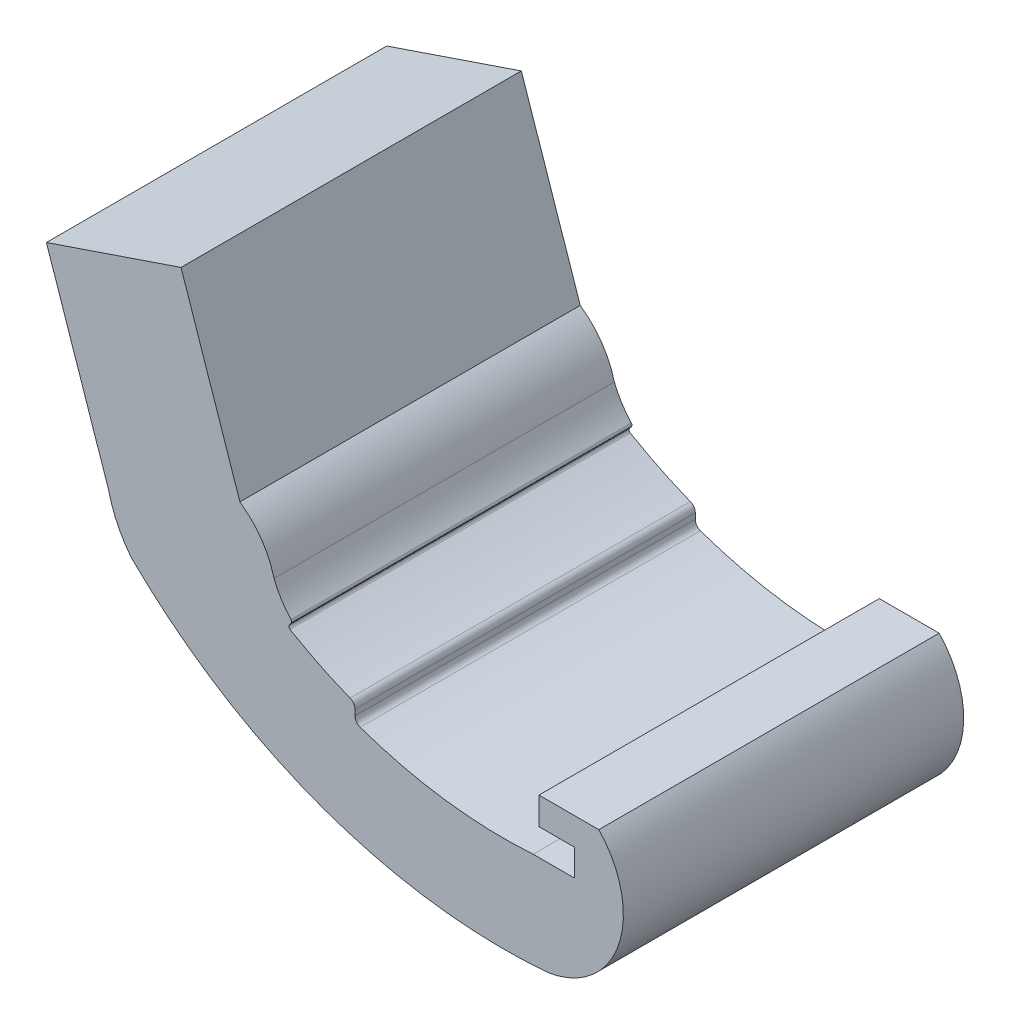
ISO-10303-21;
HEADER;
FILE_DESCRIPTION(('STEP AP214'),'2;1');
FILE_NAME('part.step','',(''),(''),'','','');
FILE_SCHEMA(('AUTOMOTIVE_DESIGN { 1 0 10303 214 1 1 1 1 }'));
ENDSEC;
DATA;
#1=APPLICATION_CONTEXT('core data for automotive mechanical design processes');
#2=APPLICATION_PROTOCOL_DEFINITION('international standard','automotive_design',2000,#1);
#3=PRODUCT_CONTEXT('',#1,'mechanical');
#4=PRODUCT('Part','Part','',(#3));
#5=PRODUCT_RELATED_PRODUCT_CATEGORY('part','',(#4));
#6=PRODUCT_DEFINITION_FORMATION('','',#4);
#7=PRODUCT_DEFINITION_CONTEXT('part definition',#1,'design');
#8=PRODUCT_DEFINITION('design','',#6,#7);
#9=PRODUCT_DEFINITION_SHAPE('','',#8);
#10=(LENGTH_UNIT() NAMED_UNIT(*) SI_UNIT(.MILLI.,.METRE.));
#11=(NAMED_UNIT(*) PLANE_ANGLE_UNIT() SI_UNIT($,.RADIAN.));
#12=(NAMED_UNIT(*) SI_UNIT($,.STERADIAN.) SOLID_ANGLE_UNIT());
#13=UNCERTAINTY_MEASURE_WITH_UNIT(LENGTH_MEASURE(1.E-05),#10,'distance_accuracy_value','');
#14=(GEOMETRIC_REPRESENTATION_CONTEXT(3) GLOBAL_UNCERTAINTY_ASSIGNED_CONTEXT((#13)) GLOBAL_UNIT_ASSIGNED_CONTEXT((#10,
#11,#12)) REPRESENTATION_CONTEXT('',''));
#15=CARTESIAN_POINT('',(0.,0.,0.));
#16=DIRECTION('',(0.,0.,1.));
#17=DIRECTION('',(1.,0.,0.));
#18=AXIS2_PLACEMENT_3D('',#15,#16,#17);
#19=CARTESIAN_POINT('',(-0.400173853732835,-10.6273283102871,17.4625));
#20=DIRECTION('',(0.,0.,-1.));
#21=DIRECTION('',(-1.,0.,0.));
#22=AXIS2_PLACEMENT_3D('',#19,#20,#21);
#23=CYLINDRICAL_SURFACE('',#22,4.40646148136154);
#24=CARTESIAN_POINT('',(-0.400173853732835,-10.6273283102871,0.));
#25=DIRECTION('',(0.,0.,1.));
#26=DIRECTION('',(1.,0.,0.));
#27=AXIS2_PLACEMENT_3D('',#24,#25,#26);
#28=CIRCLE('',#27,4.40646148136154);
#29=CARTESIAN_POINT('',(3.87016332953323,-9.54053342258376,0.));
#30=VERTEX_POINT('',#29);
#31=CARTESIAN_POINT('',(2.11862131585542,-7.0117268830856,0.));
#32=VERTEX_POINT('',#31);
#33=EDGE_CURVE('E226',#30,#32,#28,.T.);
#34=ORIENTED_EDGE('',*,*,#33,.T.);
#35=DIRECTION('',(0.,0.,-1.));
#36=VECTOR('',#35,1.);
#37=CARTESIAN_POINT('',(2.11862131585542,-7.0117268830856,17.4625));
#38=LINE('',#37,#36);
#39=CARTESIAN_POINT('',(2.11862131585542,-7.0117268830856,17.4625));
#40=VERTEX_POINT('',#39);
#41=EDGE_CURVE('E11',#40,#32,#38,.T.);
#42=ORIENTED_EDGE('',*,*,#41,.F.);
#43=CARTESIAN_POINT('',(-0.400173853732835,-10.6273283102871,17.4625));
#44=DIRECTION('',(0.,0.,1.));
#45=DIRECTION('',(1.,0.,0.));
#46=AXIS2_PLACEMENT_3D('',#43,#44,#45);
#47=CIRCLE('',#46,4.40646148136154);
#48=CARTESIAN_POINT('',(3.87016332953323,-9.54053342258376,17.4625));
#49=VERTEX_POINT('',#48);
#50=EDGE_CURVE('E307',#49,#40,#47,.T.);
#51=ORIENTED_EDGE('',*,*,#50,.F.);
#52=DIRECTION('',(0.,0.,-1.));
#53=VECTOR('',#52,1.);
#54=CARTESIAN_POINT('',(3.87016332953323,-9.54053342258376,17.4625));
#55=LINE('',#54,#53);
#56=EDGE_CURVE('E222',#49,#30,#55,.T.);
#57=ORIENTED_EDGE('',*,*,#56,.T.);
#58=EDGE_LOOP('',(#34,#42,#51,#57));
#59=FACE_BOUND('',#58,.T.);
#60=ADVANCED_FACE('F43',(#59),#23,.T.);
#61=CARTESIAN_POINT('',(2.11862131585542,-7.0117268830856,17.4625));
#62=DIRECTION('',(-0.946968063350225,-0.3213276940986,0.));
#63=DIRECTION('',(0.3213276940986,-0.946968063350225,0.));
#64=AXIS2_PLACEMENT_3D('',#61,#62,#63);
#65=PLANE('',#64);
#66=DIRECTION('',(-0.3213276940986,0.946968063350225,0.));
#67=VECTOR('',#66,1.);
#68=CARTESIAN_POINT('',(2.11862131585542,-7.0117268830856,0.));
#69=LINE('',#68,#67);
#70=CARTESIAN_POINT('',(-0.904044886539576,1.89621479889668,0.));
#71=VERTEX_POINT('',#70);
#72=EDGE_CURVE('E230',#32,#71,#69,.T.);
#73=ORIENTED_EDGE('',*,*,#72,.T.);
#74=DIRECTION('',(0.,0.,-1.));
#75=VECTOR('',#74,1.);
#76=CARTESIAN_POINT('',(-0.904044886539576,1.89621479889668,17.4625));
#77=LINE('',#76,#75);
#78=CARTESIAN_POINT('',(-0.904044886539576,1.89621479889668,17.4625));
#79=VERTEX_POINT('',#78);
#80=EDGE_CURVE('E52',#79,#71,#77,.T.);
#81=ORIENTED_EDGE('',*,*,#80,.F.);
#82=DIRECTION('',(-0.3213276940986,0.946968063350225,0.));
#83=VECTOR('',#82,1.);
#84=CARTESIAN_POINT('',(2.11862131585542,-7.0117268830856,17.4625));
#85=LINE('',#84,#83);
#86=EDGE_CURVE('E141',#40,#79,#85,.T.);
#87=ORIENTED_EDGE('',*,*,#86,.F.);
#88=ORIENTED_EDGE('',*,*,#41,.T.);
#89=EDGE_LOOP('',(#73,#81,#87,#88));
#90=FACE_BOUND('',#89,.T.);
#91=ADVANCED_FACE('F370',(#90),#65,.F.);
#92=CARTESIAN_POINT('',(-7.81199953398092,-0.450394447761099,17.4625));
#93=DIRECTION('',(-0.321645278361694,0.946860240430249,0.));
#94=DIRECTION('',(-0.946860240430249,-0.321645278361694,0.));
#95=AXIS2_PLACEMENT_3D('',#92,#93,#94);
#96=PLANE('',#95);
#97=DIRECTION('',(0.946860240430249,0.321645278361694,0.));
#98=VECTOR('',#97,1.);
#99=CARTESIAN_POINT('',(-7.81199953398092,-0.450394447761099,0.));
#100=LINE('',#99,#98);
#101=CARTESIAN_POINT('',(-7.81199953398092,-0.450394447761099,0.));
#102=VERTEX_POINT('',#101);
#103=EDGE_CURVE('E234',#102,#71,#100,.T.);
#104=ORIENTED_EDGE('',*,*,#103,.F.);
#105=DIRECTION('',(0.,0.,-1.));
#106=VECTOR('',#105,1.);
#107=CARTESIAN_POINT('',(-7.81199953398092,-0.450394447761099,17.4625));
#108=LINE('',#107,#106);
#109=CARTESIAN_POINT('',(-7.81199953398092,-0.450394447761099,17.4625));
#110=VERTEX_POINT('',#109);
#111=EDGE_CURVE('E361',#110,#102,#108,.T.);
#112=ORIENTED_EDGE('',*,*,#111,.F.);
#113=DIRECTION('',(0.946860240430249,0.321645278361694,0.));
#114=VECTOR('',#113,1.);
#115=CARTESIAN_POINT('',(-7.81199953398092,-0.450394447761099,17.4625));
#116=LINE('',#115,#114);
#117=EDGE_CURVE('E369',#110,#79,#116,.T.);
#118=ORIENTED_EDGE('',*,*,#117,.T.);
#119=ORIENTED_EDGE('',*,*,#80,.T.);
#120=EDGE_LOOP('',(#104,#112,#118,#119));
#121=FACE_BOUND('',#120,.T.);
#122=ADVANCED_FACE('F367',(#121),#96,.T.);
#123=CARTESIAN_POINT('',(-4.62053027410547,-9.84770584749789,17.4625));
#124=DIRECTION('',(-0.946883750563869,-0.321576060859791,0.));
#125=DIRECTION('',(0.321576060859791,-0.946883750563869,0.));
#126=AXIS2_PLACEMENT_3D('',#123,#124,#125);
#127=PLANE('',#126);
#128=DIRECTION('',(-0.321576060859791,0.946883750563869,0.));
#129=VECTOR('',#128,1.);
#130=CARTESIAN_POINT('',(-4.62053027410547,-9.84770584749789,0.));
#131=LINE('',#130,#129);
#132=CARTESIAN_POINT('',(-4.62053027410547,-9.84770584749789,0.));
#133=VERTEX_POINT('',#132);
#134=EDGE_CURVE('E238',#133,#102,#131,.T.);
#135=ORIENTED_EDGE('',*,*,#134,.F.);
#136=DIRECTION('',(0.,0.,-1.));
#137=VECTOR('',#136,1.);
#138=CARTESIAN_POINT('',(-4.62053027410547,-9.84770584749789,17.4625));
#139=LINE('',#138,#137);
#140=CARTESIAN_POINT('',(-4.62053027410547,-9.84770584749789,17.4625));
#141=VERTEX_POINT('',#140);
#142=EDGE_CURVE('E358',#141,#133,#139,.T.);
#143=ORIENTED_EDGE('',*,*,#142,.F.);
#144=DIRECTION('',(-0.321576060859791,0.946883750563869,0.));
#145=VECTOR('',#144,1.);
#146=CARTESIAN_POINT('',(-4.62053027410547,-9.84770584749789,17.4625));
#147=LINE('',#146,#145);
#148=EDGE_CURVE('E381',#141,#110,#147,.T.);
#149=ORIENTED_EDGE('',*,*,#148,.T.);
#150=ORIENTED_EDGE('',*,*,#111,.T.);
#151=EDGE_LOOP('',(#135,#143,#149,#150));
#152=FACE_BOUND('',#151,.T.);
#153=ADVANCED_FACE('F378',(#152),#127,.T.);
#154=CARTESIAN_POINT('',(1.35666981438143,-8.4780045902162,17.4625));
#155=DIRECTION('',(0.,0.,-1.));
#156=DIRECTION('',(-1.,0.,0.));
#157=AXIS2_PLACEMENT_3D('',#154,#155,#156);
#158=CYLINDRICAL_SURFACE('',#157,6.13212870315094);
#159=CARTESIAN_POINT('',(1.35666981438143,-8.4780045902162,0.));
#160=DIRECTION('',(0.,0.,-1.));
#161=DIRECTION('',(-1.,0.,0.));
#162=AXIS2_PLACEMENT_3D('',#159,#160,#161);
#163=CIRCLE('',#162,6.13212870315094);
#164=CARTESIAN_POINT('',(-3.45613776195569,-12.2779895461285,0.));
#165=VERTEX_POINT('',#164);
#166=EDGE_CURVE('E242',#165,#133,#163,.T.);
#167=ORIENTED_EDGE('',*,*,#166,.F.);
#168=DIRECTION('',(0.,0.,-1.));
#169=VECTOR('',#168,1.);
#170=CARTESIAN_POINT('',(-3.45613776195569,-12.2779895461285,17.4625));
#171=LINE('',#170,#169);
#172=CARTESIAN_POINT('',(-3.45613776195569,-12.2779895461285,17.4625));
#173=VERTEX_POINT('',#172);
#174=EDGE_CURVE('E355',#173,#165,#171,.T.);
#175=ORIENTED_EDGE('',*,*,#174,.F.);
#176=CARTESIAN_POINT('',(1.35666981438143,-8.4780045902162,17.4625));
#177=DIRECTION('',(0.,0.,-1.));
#178=DIRECTION('',(-1.,0.,0.));
#179=AXIS2_PLACEMENT_3D('',#176,#177,#178);
#180=CIRCLE('',#179,6.13212870315094);
#181=EDGE_CURVE('E388',#173,#141,#180,.T.);
#182=ORIENTED_EDGE('',*,*,#181,.T.);
#183=ORIENTED_EDGE('',*,*,#142,.T.);
#184=EDGE_LOOP('',(#167,#175,#182,#183));
#185=FACE_BOUND('',#184,.T.);
#186=ADVANCED_FACE('F469',(#185),#158,.T.);
#187=CARTESIAN_POINT('',(15.6571705334137,7.0966921737828,17.4625));
#188=DIRECTION('',(0.,0.,-1.));
#189=DIRECTION('',(-1.,0.,0.));
#190=AXIS2_PLACEMENT_3D('',#187,#188,#189);
#191=CYLINDRICAL_SURFACE('',#190,27.2157462830197);
#192=CARTESIAN_POINT('',(15.6571705334137,7.0966921737828,0.));
#193=DIRECTION('',(0.,0.,-1.));
#194=DIRECTION('',(-1.,0.,0.));
#195=AXIS2_PLACEMENT_3D('',#192,#193,#194);
#196=CIRCLE('',#195,27.2157462830197);
#197=CARTESIAN_POINT('',(17.9218692618326,-20.0246644554716,0.));
#198=VERTEX_POINT('',#197);
#199=EDGE_CURVE('E246',#198,#165,#196,.T.);
#200=ORIENTED_EDGE('',*,*,#199,.F.);
#201=DIRECTION('',(0.,0.,-1.));
#202=VECTOR('',#201,1.);
#203=CARTESIAN_POINT('',(17.9218692618326,-20.0246644554716,17.4625));
#204=LINE('',#203,#202);
#205=CARTESIAN_POINT('',(17.9218692618326,-20.0246644554716,17.4625));
#206=VERTEX_POINT('',#205);
#207=EDGE_CURVE('E352',#206,#198,#204,.T.);
#208=ORIENTED_EDGE('',*,*,#207,.F.);
#209=CARTESIAN_POINT('',(15.6571705334137,7.0966921737828,17.4625));
#210=DIRECTION('',(0.,0.,-1.));
#211=DIRECTION('',(-1.,0.,0.));
#212=AXIS2_PLACEMENT_3D('',#209,#210,#211);
#213=CIRCLE('',#212,27.2157462830197);
#214=EDGE_CURVE('E395',#206,#173,#213,.T.);
#215=ORIENTED_EDGE('',*,*,#214,.T.);
#216=ORIENTED_EDGE('',*,*,#174,.T.);
#217=EDGE_LOOP('',(#200,#208,#215,#216));
#218=FACE_BOUND('',#217,.T.);
#219=ADVANCED_FACE('F472',(#218),#191,.T.);
#220=CARTESIAN_POINT('',(17.231651126082,-15.515017768837,17.4625));
#221=DIRECTION('',(0.,0.,-1.));
#222=DIRECTION('',(-1.,0.,0.));
#223=AXIS2_PLACEMENT_3D('',#220,#221,#222);
#224=CYLINDRICAL_SURFACE('',#223,4.56216114502693);
#225=CARTESIAN_POINT('',(17.231651126082,-15.515017768837,0.));
#226=DIRECTION('',(0.,0.,1.));
#227=DIRECTION('',(1.,0.,0.));
#228=AXIS2_PLACEMENT_3D('',#225,#226,#227);
#229=CIRCLE('',#228,4.56216114502693);
#230=CARTESIAN_POINT('',(20.5351793605568,-12.3685887584792,0.));
#231=VERTEX_POINT('',#230);
#232=EDGE_CURVE('E250',#198,#231,#229,.T.);
#233=ORIENTED_EDGE('',*,*,#232,.T.);
#234=DIRECTION('',(0.,0.,-1.));
#235=VECTOR('',#234,1.);
#236=CARTESIAN_POINT('',(20.5351793605568,-12.3685887584792,17.4625));
#237=LINE('',#236,#235);
#238=CARTESIAN_POINT('',(20.5351793605568,-12.3685887584792,17.4625));
#239=VERTEX_POINT('',#238);
#240=EDGE_CURVE('E349',#239,#231,#237,.T.);
#241=ORIENTED_EDGE('',*,*,#240,.F.);
#242=CARTESIAN_POINT('',(17.231651126082,-15.515017768837,17.4625));
#243=DIRECTION('',(0.,0.,1.));
#244=DIRECTION('',(1.,0.,0.));
#245=AXIS2_PLACEMENT_3D('',#242,#243,#244);
#246=CIRCLE('',#245,4.56216114502693);
#247=EDGE_CURVE('E399',#206,#239,#246,.T.);
#248=ORIENTED_EDGE('',*,*,#247,.F.);
#249=ORIENTED_EDGE('',*,*,#207,.T.);
#250=EDGE_LOOP('',(#233,#241,#248,#249));
#251=FACE_BOUND('',#250,.T.);
#252=ADVANCED_FACE('F476',(#251),#224,.T.);
#253=CARTESIAN_POINT('',(17.4624362857741,-12.3685887584792,17.4625));
#254=DIRECTION('',(0.,1.,0.));
#255=DIRECTION('',(0.,0.,1.));
#256=AXIS2_PLACEMENT_3D('',#253,#254,#255);
#257=PLANE('',#256);
#258=DIRECTION('',(1.,0.,0.));
#259=VECTOR('',#258,1.);
#260=CARTESIAN_POINT('',(17.4624362857741,-12.3685887584792,0.));
#261=LINE('',#260,#259);
#262=CARTESIAN_POINT('',(17.4624362857741,-12.3685887584792,0.));
#263=VERTEX_POINT('',#262);
#264=EDGE_CURVE('E254',#263,#231,#261,.T.);
#265=ORIENTED_EDGE('',*,*,#264,.F.);
#266=DIRECTION('',(0.,0.,-1.));
#267=VECTOR('',#266,1.);
#268=CARTESIAN_POINT('',(17.4624362857741,-12.3685887584792,17.4625));
#269=LINE('',#268,#267);
#270=CARTESIAN_POINT('',(17.4624362857741,-12.3685887584792,17.4625));
#271=VERTEX_POINT('',#270);
#272=EDGE_CURVE('E346',#271,#263,#269,.T.);
#273=ORIENTED_EDGE('',*,*,#272,.F.);
#274=DIRECTION('',(1.,0.,0.));
#275=VECTOR('',#274,1.);
#276=CARTESIAN_POINT('',(17.4624362857741,-12.3685887584792,17.4625));
#277=LINE('',#276,#275);
#278=EDGE_CURVE('E402',#271,#239,#277,.T.);
#279=ORIENTED_EDGE('',*,*,#278,.T.);
#280=ORIENTED_EDGE('',*,*,#240,.T.);
#281=EDGE_LOOP('',(#265,#273,#279,#280));
#282=FACE_BOUND('',#281,.T.);
#283=ADVANCED_FACE('F480',(#282),#257,.T.);
#284=CARTESIAN_POINT('',(17.4624362857741,-13.7719387584792,17.4625));
#285=DIRECTION('',(-1.,0.,0.));
#286=DIRECTION('',(0.,0.,1.));
#287=AXIS2_PLACEMENT_3D('',#284,#285,#286);
#288=PLANE('',#287);
#289=DIRECTION('',(0.,1.,0.));
#290=VECTOR('',#289,1.);
#291=CARTESIAN_POINT('',(17.4624362857741,-13.7719387584792,0.));
#292=LINE('',#291,#290);
#293=CARTESIAN_POINT('',(17.4624362857741,-13.7719387584792,0.));
#294=VERTEX_POINT('',#293);
#295=EDGE_CURVE('E258',#294,#263,#292,.T.);
#296=ORIENTED_EDGE('',*,*,#295,.F.);
#297=DIRECTION('',(0.,0.,-1.));
#298=VECTOR('',#297,1.);
#299=CARTESIAN_POINT('',(17.4624362857741,-13.7719387584792,17.4625));
#300=LINE('',#299,#298);
#301=CARTESIAN_POINT('',(17.4624362857741,-13.7719387584792,17.4625));
#302=VERTEX_POINT('',#301);
#303=EDGE_CURVE('E343',#302,#294,#300,.T.);
#304=ORIENTED_EDGE('',*,*,#303,.F.);
#305=DIRECTION('',(0.,1.,0.));
#306=VECTOR('',#305,1.);
#307=CARTESIAN_POINT('',(17.4624362857741,-13.7719387584792,17.4625));
#308=LINE('',#307,#306);
#309=EDGE_CURVE('E406',#302,#271,#308,.T.);
#310=ORIENTED_EDGE('',*,*,#309,.T.);
#311=ORIENTED_EDGE('',*,*,#272,.T.);
#312=EDGE_LOOP('',(#296,#304,#310,#311));
#313=FACE_BOUND('',#312,.T.);
#314=ADVANCED_FACE('F484',(#313),#288,.T.);
#315=CARTESIAN_POINT('',(19.2756197402024,-13.7719387584792,17.4625));
#316=DIRECTION('',(0.,-1.,0.));
#317=DIRECTION('',(0.,0.,-1.));
#318=AXIS2_PLACEMENT_3D('',#315,#316,#317);
#319=PLANE('',#318);
#320=DIRECTION('',(-1.,0.,0.));
#321=VECTOR('',#320,1.);
#322=CARTESIAN_POINT('',(19.2756197402024,-13.7719387584792,0.));
#323=LINE('',#322,#321);
#324=CARTESIAN_POINT('',(19.2756197402024,-13.7719387584792,0.));
#325=VERTEX_POINT('',#324);
#326=EDGE_CURVE('E262',#325,#294,#323,.T.);
#327=ORIENTED_EDGE('',*,*,#326,.F.);
#328=DIRECTION('',(0.,0.,-1.));
#329=VECTOR('',#328,1.);
#330=CARTESIAN_POINT('',(19.2756197402024,-13.7719387584792,17.4625));
#331=LINE('',#330,#329);
#332=CARTESIAN_POINT('',(19.2756197402024,-13.7719387584792,17.4625));
#333=VERTEX_POINT('',#332);
#334=EDGE_CURVE('E340',#333,#325,#331,.T.);
#335=ORIENTED_EDGE('',*,*,#334,.F.);
#336=DIRECTION('',(-1.,0.,0.));
#337=VECTOR('',#336,1.);
#338=CARTESIAN_POINT('',(19.2756197402024,-13.7719387584792,17.4625));
#339=LINE('',#338,#337);
#340=EDGE_CURVE('E410',#333,#302,#339,.T.);
#341=ORIENTED_EDGE('',*,*,#340,.T.);
#342=ORIENTED_EDGE('',*,*,#303,.T.);
#343=EDGE_LOOP('',(#327,#335,#341,#342));
#344=FACE_BOUND('',#343,.T.);
#345=ADVANCED_FACE('F488',(#344),#319,.T.);
#346=CARTESIAN_POINT('',(19.2756197402024,-15.1213137584792,17.4625));
#347=DIRECTION('',(-1.,0.,0.));
#348=DIRECTION('',(0.,0.,1.));
#349=AXIS2_PLACEMENT_3D('',#346,#347,#348);
#350=PLANE('',#349);
#351=DIRECTION('',(0.,1.,0.));
#352=VECTOR('',#351,1.);
#353=CARTESIAN_POINT('',(19.2756197402024,-15.1213137584792,0.));
#354=LINE('',#353,#352);
#355=CARTESIAN_POINT('',(19.2756197402024,-15.1213137584792,0.));
#356=VERTEX_POINT('',#355);
#357=EDGE_CURVE('E266',#356,#325,#354,.T.);
#358=ORIENTED_EDGE('',*,*,#357,.F.);
#359=DIRECTION('',(0.,0.,-1.));
#360=VECTOR('',#359,1.);
#361=CARTESIAN_POINT('',(19.2756197402024,-15.1213137584792,17.4625));
#362=LINE('',#361,#360);
#363=CARTESIAN_POINT('',(19.2756197402024,-15.1213137584792,17.4625));
#364=VERTEX_POINT('',#363);
#365=EDGE_CURVE('E337',#364,#356,#362,.T.);
#366=ORIENTED_EDGE('',*,*,#365,.F.);
#367=DIRECTION('',(0.,1.,0.));
#368=VECTOR('',#367,1.);
#369=CARTESIAN_POINT('',(19.2756197402024,-15.1213137584792,17.4625));
#370=LINE('',#369,#368);
#371=EDGE_CURVE('E414',#364,#333,#370,.T.);
#372=ORIENTED_EDGE('',*,*,#371,.T.);
#373=ORIENTED_EDGE('',*,*,#334,.T.);
#374=EDGE_LOOP('',(#358,#366,#372,#373));
#375=FACE_BOUND('',#374,.T.);
#376=ADVANCED_FACE('F492',(#375),#350,.T.);
#377=CARTESIAN_POINT('',(19.2502197402024,-15.1213137584792,17.4625));
#378=DIRECTION('',(0.,0.,-1.));
#379=DIRECTION('',(-1.,0.,0.));
#380=AXIS2_PLACEMENT_3D('',#377,#378,#379);
#381=CYLINDRICAL_SURFACE('',#380,0.0253999999999992);
#382=CARTESIAN_POINT('',(19.2502197402024,-15.1213137584792,0.));
#383=DIRECTION('',(0.,0.,-1.));
#384=DIRECTION('',(-1.,0.,0.));
#385=AXIS2_PLACEMENT_3D('',#382,#383,#384);
#386=CIRCLE('',#385,0.0253999999999992);
#387=CARTESIAN_POINT('',(19.2502197402024,-15.1467137584792,0.));
#388=VERTEX_POINT('',#387);
#389=EDGE_CURVE('E270',#356,#388,#386,.T.);
#390=ORIENTED_EDGE('',*,*,#389,.T.);
#391=DIRECTION('',(0.,0.,-1.));
#392=VECTOR('',#391,1.);
#393=CARTESIAN_POINT('',(19.2502197402024,-15.1467137584792,17.4625));
#394=LINE('',#393,#392);
#395=CARTESIAN_POINT('',(19.2502197402024,-15.1467137584792,17.4625));
#396=VERTEX_POINT('',#395);
#397=EDGE_CURVE('E334',#396,#388,#394,.T.);
#398=ORIENTED_EDGE('',*,*,#397,.F.);
#399=CARTESIAN_POINT('',(19.2502197402024,-15.1213137584792,17.4625));
#400=DIRECTION('',(0.,0.,-1.));
#401=DIRECTION('',(-1.,0.,0.));
#402=AXIS2_PLACEMENT_3D('',#399,#400,#401);
#403=CIRCLE('',#402,0.0253999999999992);
#404=EDGE_CURVE('E418',#364,#396,#403,.T.);
#405=ORIENTED_EDGE('',*,*,#404,.F.);
#406=ORIENTED_EDGE('',*,*,#365,.T.);
#407=EDGE_LOOP('',(#390,#398,#405,#406));
#408=FACE_BOUND('',#407,.T.);
#409=ADVANCED_FACE('F496',(#408),#381,.F.);
#410=CARTESIAN_POINT('',(17.165632348041,-15.1467137584792,17.4625));
#411=DIRECTION('',(0.,1.,0.));
#412=DIRECTION('',(-1.,0.,0.));
#413=AXIS2_PLACEMENT_3D('',#410,#411,#412);
#414=PLANE('',#413);
#415=DIRECTION('',(1.,0.,0.));
#416=VECTOR('',#415,1.);
#417=CARTESIAN_POINT('',(17.165632348041,-15.1467137584792,0.));
#418=LINE('',#417,#416);
#419=CARTESIAN_POINT('',(17.165632348041,-15.1467137584792,0.));
#420=VERTEX_POINT('',#419);
#421=EDGE_CURVE('E274',#420,#388,#418,.T.);
#422=ORIENTED_EDGE('',*,*,#421,.F.);
#423=DIRECTION('',(0.,0.,-1.));
#424=VECTOR('',#423,1.);
#425=CARTESIAN_POINT('',(17.165632348041,-15.1467137584792,17.4625));
#426=LINE('',#425,#424);
#427=CARTESIAN_POINT('',(17.165632348041,-15.1467137584792,17.4625));
#428=VERTEX_POINT('',#427);
#429=EDGE_CURVE('E331',#428,#420,#426,.T.);
#430=ORIENTED_EDGE('',*,*,#429,.F.);
#431=DIRECTION('',(1.,0.,0.));
#432=VECTOR('',#431,1.);
#433=CARTESIAN_POINT('',(17.165632348041,-15.1467137584792,17.4625));
#434=LINE('',#433,#432);
#435=EDGE_CURVE('E421',#428,#396,#434,.T.);
#436=ORIENTED_EDGE('',*,*,#435,.T.);
#437=ORIENTED_EDGE('',*,*,#397,.T.);
#438=EDGE_LOOP('',(#422,#430,#436,#437));
#439=FACE_BOUND('',#438,.T.);
#440=ADVANCED_FACE('F500',(#439),#414,.T.);
#441=CARTESIAN_POINT('',(15.6571705334137,7.0966921737828,17.4625));
#442=DIRECTION('',(0.,0.,-1.));
#443=DIRECTION('',(-1.,0.,0.));
#444=AXIS2_PLACEMENT_3D('',#441,#442,#443);
#445=CYLINDRICAL_SURFACE('',#444,22.2944962830196);
#446=CARTESIAN_POINT('',(15.6571705334137,7.0966921737828,0.));
#447=DIRECTION('',(0.,0.,-1.));
#448=DIRECTION('',(-1.,0.,0.));
#449=AXIS2_PLACEMENT_3D('',#446,#447,#448);
#450=CIRCLE('',#449,22.2944962830196);
#451=CARTESIAN_POINT('',(8.28711836823177,-13.9443842149401,0.));
#452=VERTEX_POINT('',#451);
#453=EDGE_CURVE('E278',#420,#452,#450,.T.);
#454=ORIENTED_EDGE('',*,*,#453,.T.);
#455=DIRECTION('',(0.,0.,-1.));
#456=VECTOR('',#455,1.);
#457=CARTESIAN_POINT('',(8.28711836823177,-13.9443842149401,17.4625));
#458=LINE('',#457,#456);
#459=CARTESIAN_POINT('',(8.28711836823177,-13.9443842149401,17.4625));
#460=VERTEX_POINT('',#459);
#461=EDGE_CURVE('E327',#460,#452,#458,.T.);
#462=ORIENTED_EDGE('',*,*,#461,.F.);
#463=CARTESIAN_POINT('',(15.6571705334137,7.0966921737828,17.4625));
#464=DIRECTION('',(0.,0.,-1.));
#465=DIRECTION('',(-1.,0.,0.));
#466=AXIS2_PLACEMENT_3D('',#463,#464,#465);
#467=CIRCLE('',#466,22.2944962830196);
#468=EDGE_CURVE('E425',#428,#460,#467,.T.);
#469=ORIENTED_EDGE('',*,*,#468,.F.);
#470=ORIENTED_EDGE('',*,*,#429,.T.);
#471=EDGE_LOOP('',(#454,#462,#469,#470));
#472=FACE_BOUND('',#471,.T.);
#473=ADVANCED_FACE('F504',(#472),#445,.F.);
#474=CARTESIAN_POINT('',(8.41831619463362,-13.5698219424507,17.4625));
#475=DIRECTION('',(0.,0.,-1.));
#476=DIRECTION('',(-1.,0.,0.));
#477=AXIS2_PLACEMENT_3D('',#474,#475,#476);
#478=CYLINDRICAL_SURFACE('',#477,0.396875);
#479=CARTESIAN_POINT('',(8.41831619463362,-13.5698219424507,0.));
#480=DIRECTION('',(0.,0.,-1.));
#481=DIRECTION('',(-1.,0.,0.));
#482=AXIS2_PLACEMENT_3D('',#479,#480,#481);
#483=CIRCLE('',#482,0.396875);
#484=CARTESIAN_POINT('',(8.02144119463362,-13.5698219424507,0.));
#485=VERTEX_POINT('',#484);
#486=EDGE_CURVE('E281',#452,#485,#483,.T.);
#487=ORIENTED_EDGE('',*,*,#486,.T.);
#488=DIRECTION('',(0.,0.,-1.));
#489=VECTOR('',#488,1.);
#490=CARTESIAN_POINT('',(8.02144119463362,-13.5698219424507,17.4625));
#491=LINE('',#490,#489);
#492=CARTESIAN_POINT('',(8.02144119463362,-13.5698219424507,17.4625));
#493=VERTEX_POINT('',#492);
#494=EDGE_CURVE('E323',#493,#485,#491,.T.);
#495=ORIENTED_EDGE('',*,*,#494,.F.);
#496=CARTESIAN_POINT('',(8.41831619463362,-13.5698219424507,17.4625));
#497=DIRECTION('',(0.,0.,-1.));
#498=DIRECTION('',(-1.,0.,0.));
#499=AXIS2_PLACEMENT_3D('',#496,#497,#498);
#500=CIRCLE('',#499,0.396875);
#501=EDGE_CURVE('E428',#460,#493,#500,.T.);
#502=ORIENTED_EDGE('',*,*,#501,.F.);
#503=ORIENTED_EDGE('',*,*,#461,.T.);
#504=EDGE_LOOP('',(#487,#495,#502,#503));
#505=FACE_BOUND('',#504,.T.);
#506=ADVANCED_FACE('F508',(#505),#478,.F.);
#507=CARTESIAN_POINT('',(8.02144119463362,-13.5698219424507,17.4625));
#508=DIRECTION('',(-1.,0.,0.));
#509=DIRECTION('',(0.,0.,1.));
#510=AXIS2_PLACEMENT_3D('',#507,#508,#509);
#511=PLANE('',#510);
#512=DIRECTION('',(0.,1.,0.));
#513=VECTOR('',#512,1.);
#514=CARTESIAN_POINT('',(8.02144119463362,-13.5698219424507,0.));
#515=LINE('',#514,#513);
#516=CARTESIAN_POINT('',(8.02144119463362,-13.2744414567044,0.));
#517=VERTEX_POINT('',#516);
#518=EDGE_CURVE('E284',#485,#517,#515,.T.);
#519=ORIENTED_EDGE('',*,*,#518,.T.);
#520=DIRECTION('',(0.,0.,-1.));
#521=VECTOR('',#520,1.);
#522=CARTESIAN_POINT('',(8.02144119463362,-13.2744414567044,17.4625));
#523=LINE('',#522,#521);
#524=CARTESIAN_POINT('',(8.02144119463362,-13.2744414567044,17.4625));
#525=VERTEX_POINT('',#524);
#526=EDGE_CURVE('E320',#525,#517,#523,.T.);
#527=ORIENTED_EDGE('',*,*,#526,.F.);
#528=DIRECTION('',(0.,1.,0.));
#529=VECTOR('',#528,1.);
#530=CARTESIAN_POINT('',(8.02144119463362,-13.5698219424507,17.4625));
#531=LINE('',#530,#529);
#532=EDGE_CURVE('E431',#493,#525,#531,.T.);
#533=ORIENTED_EDGE('',*,*,#532,.F.);
#534=ORIENTED_EDGE('',*,*,#494,.T.);
#535=EDGE_LOOP('',(#519,#527,#533,#534));
#536=FACE_BOUND('',#535,.T.);
#537=ADVANCED_FACE('F512',(#536),#511,.F.);
#538=CARTESIAN_POINT('',(7.62456619463362,-13.2744414567044,17.4625));
#539=DIRECTION('',(0.,0.,-1.));
#540=DIRECTION('',(-1.,0.,0.));
#541=AXIS2_PLACEMENT_3D('',#538,#539,#540);
#542=CYLINDRICAL_SURFACE('',#541,0.396875000000001);
#543=CARTESIAN_POINT('',(7.62456619463362,-13.2744414567044,0.));
#544=DIRECTION('',(0.,0.,-1.));
#545=DIRECTION('',(-1.,0.,0.));
#546=AXIS2_PLACEMENT_3D('',#543,#544,#545);
#547=CIRCLE('',#546,0.396875000000001);
#548=CARTESIAN_POINT('',(7.7701500370862,-12.9052326940216,0.));
#549=VERTEX_POINT('',#548);
#550=EDGE_CURVE('E288',#549,#517,#547,.T.);
#551=ORIENTED_EDGE('',*,*,#550,.F.);
#552=DIRECTION('',(0.,0.,-1.));
#553=VECTOR('',#552,1.);
#554=CARTESIAN_POINT('',(7.7701500370862,-12.9052326940216,17.4625));
#555=LINE('',#554,#553);
#556=CARTESIAN_POINT('',(7.7701500370862,-12.9052326940216,17.4625));
#557=VERTEX_POINT('',#556);
#558=EDGE_CURVE('E317',#557,#549,#555,.T.);
#559=ORIENTED_EDGE('',*,*,#558,.F.);
#560=CARTESIAN_POINT('',(7.62456619463362,-13.2744414567044,17.4625));
#561=DIRECTION('',(0.,0.,-1.));
#562=DIRECTION('',(-1.,0.,0.));
#563=AXIS2_PLACEMENT_3D('',#560,#561,#562);
#564=CIRCLE('',#563,0.396875000000001);
#565=EDGE_CURVE('E434',#557,#525,#564,.T.);
#566=ORIENTED_EDGE('',*,*,#565,.T.);
#567=ORIENTED_EDGE('',*,*,#526,.T.);
#568=EDGE_LOOP('',(#551,#559,#566,#567));
#569=FACE_BOUND('',#568,.T.);
#570=ADVANCED_FACE('F516',(#569),#542,.T.);
#571=CARTESIAN_POINT('',(15.6571705334137,7.0966921737828,17.4625));
#572=DIRECTION('',(0.,0.,-1.));
#573=DIRECTION('',(-1.,0.,0.));
#574=AXIS2_PLACEMENT_3D('',#571,#572,#573);
#575=CYLINDRICAL_SURFACE('',#574,21.5007462830196);
#576=CARTESIAN_POINT('',(15.6571705334137,7.0966921737828,0.));
#577=DIRECTION('',(0.,0.,-1.));
#578=DIRECTION('',(-1.,0.,0.));
#579=AXIS2_PLACEMENT_3D('',#576,#577,#578);
#580=CIRCLE('',#579,21.5007462830196);
#581=CARTESIAN_POINT('',(4.68641697762169,-11.3945126854161,0.));
#582=VERTEX_POINT('',#581);
#583=EDGE_CURVE('E292',#549,#582,#580,.T.);
#584=ORIENTED_EDGE('',*,*,#583,.T.);
#585=DIRECTION('',(0.,0.,-1.));
#586=VECTOR('',#585,1.);
#587=CARTESIAN_POINT('',(4.68641697762169,-11.3945126854161,17.4625));
#588=LINE('',#587,#586);
#589=CARTESIAN_POINT('',(4.68641697762169,-11.3945126854161,17.4625));
#590=VERTEX_POINT('',#589);
#591=EDGE_CURVE('E314',#590,#582,#588,.T.);
#592=ORIENTED_EDGE('',*,*,#591,.F.);
#593=CARTESIAN_POINT('',(15.6571705334137,7.0966921737828,17.4625));
#594=DIRECTION('',(0.,0.,-1.));
#595=DIRECTION('',(-1.,0.,0.));
#596=AXIS2_PLACEMENT_3D('',#593,#594,#595);
#597=CIRCLE('',#596,21.5007462830196);
#598=EDGE_CURVE('E438',#557,#590,#597,.T.);
#599=ORIENTED_EDGE('',*,*,#598,.F.);
#600=ORIENTED_EDGE('',*,*,#558,.T.);
#601=EDGE_LOOP('',(#584,#592,#599,#600));
#602=FACE_BOUND('',#601,.T.);
#603=ADVANCED_FACE('F520',(#602),#575,.F.);
#604=CARTESIAN_POINT('',(4.75121871441935,-11.285289359574,17.4625));
#605=DIRECTION('',(0.,0.,-1.));
#606=DIRECTION('',(-1.,0.,0.));
#607=AXIS2_PLACEMENT_3D('',#604,#605,#606);
#608=CYLINDRICAL_SURFACE('',#607,0.127000000000001);
#609=CARTESIAN_POINT('',(4.75121871441935,-11.285289359574,0.));
#610=DIRECTION('',(0.,0.,1.));
#611=DIRECTION('',(1.,0.,0.));
#612=AXIS2_PLACEMENT_3D('',#609,#610,#611);
#613=CIRCLE('',#612,0.127000000000001);
#614=CARTESIAN_POINT('',(4.65165057943148,-11.2064529054741,0.));
#615=VERTEX_POINT('',#614);
#616=EDGE_CURVE('E296',#615,#582,#613,.T.);
#617=ORIENTED_EDGE('',*,*,#616,.F.);
#618=DIRECTION('',(0.,0.,-1.));
#619=VECTOR('',#618,1.);
#620=CARTESIAN_POINT('',(4.65165057943148,-11.2064529054741,17.4625));
#621=LINE('',#620,#619);
#622=CARTESIAN_POINT('',(4.65165057943148,-11.2064529054741,17.4625));
#623=VERTEX_POINT('',#622);
#624=EDGE_CURVE('E209',#623,#615,#621,.T.);
#625=ORIENTED_EDGE('',*,*,#624,.F.);
#626=CARTESIAN_POINT('',(4.75121871441935,-11.285289359574,17.4625));
#627=DIRECTION('',(0.,0.,1.));
#628=DIRECTION('',(1.,0.,0.));
#629=AXIS2_PLACEMENT_3D('',#626,#627,#628);
#630=CIRCLE('',#629,0.127000000000001);
#631=EDGE_CURVE('E215',#623,#590,#630,.T.);
#632=ORIENTED_EDGE('',*,*,#631,.T.);
#633=ORIENTED_EDGE('',*,*,#591,.T.);
#634=EDGE_LOOP('',(#617,#625,#632,#633));
#635=FACE_BOUND('',#634,.T.);
#636=ADVANCED_FACE('F443',(#635),#608,.F.);
#637=CARTESIAN_POINT('',(4.74212124899395,-11.0921910967425,17.4625));
#638=DIRECTION('',(0.784001062896622,-0.620759481101148,0.));
#639=DIRECTION('',(0.620759481101148,0.784001062896622,0.));
#640=AXIS2_PLACEMENT_3D('',#637,#638,#639);
#641=PLANE('',#640);
#642=DIRECTION('',(-0.620759481101148,-0.784001062896622,0.));
#643=VECTOR('',#642,1.);
#644=CARTESIAN_POINT('',(4.74212124899395,-11.0921910967425,0.));
#645=LINE('',#644,#643);
#646=CARTESIAN_POINT('',(4.74212124899395,-11.0921910967425,0.));
#647=VERTEX_POINT('',#646);
#648=EDGE_CURVE('E203',#647,#615,#645,.T.);
#649=ORIENTED_EDGE('',*,*,#648,.F.);
#650=DIRECTION('',(0.,0.,-1.));
#651=VECTOR('',#650,1.);
#652=CARTESIAN_POINT('',(4.74212124899395,-11.0921910967425,17.4625));
#653=LINE('',#652,#651);
#654=CARTESIAN_POINT('',(4.74212124899395,-11.0921910967425,17.4625));
#655=VERTEX_POINT('',#654);
#656=EDGE_CURVE('E198',#655,#647,#653,.T.);
#657=ORIENTED_EDGE('',*,*,#656,.F.);
#658=DIRECTION('',(-0.620759481101148,-0.784001062896622,0.));
#659=VECTOR('',#658,1.);
#660=CARTESIAN_POINT('',(4.74212124899395,-11.0921910967425,17.4625));
#661=LINE('',#660,#659);
#662=EDGE_CURVE('E201',#655,#623,#661,.T.);
#663=ORIENTED_EDGE('',*,*,#662,.T.);
#664=ORIENTED_EDGE('',*,*,#624,.T.);
#665=EDGE_LOOP('',(#649,#657,#663,#664));
#666=FACE_BOUND('',#665,.T.);
#667=ADVANCED_FACE('F200',(#666),#641,.T.);
#668=CARTESIAN_POINT('',(4.64255311400608,-11.0133546426426,17.4625));
#669=DIRECTION('',(0.,0.,-1.));
#670=DIRECTION('',(-1.,0.,0.));
#671=AXIS2_PLACEMENT_3D('',#668,#669,#670);
#672=CYLINDRICAL_SURFACE('',#671,0.127000000000001);
#673=CARTESIAN_POINT('',(4.64255311400608,-11.0133546426426,0.));
#674=DIRECTION('',(0.,0.,-1.));
#675=DIRECTION('',(-1.,0.,0.));
#676=AXIS2_PLACEMENT_3D('',#673,#674,#675);
#677=CIRCLE('',#676,0.127000000000001);
#678=CARTESIAN_POINT('',(4.7361220732765,-10.927483519085,0.));
#679=VERTEX_POINT('',#678);
#680=EDGE_CURVE('E302',#679,#647,#677,.T.);
#681=ORIENTED_EDGE('',*,*,#680,.F.);
#682=DIRECTION('',(0.,0.,-1.));
#683=VECTOR('',#682,1.);
#684=CARTESIAN_POINT('',(4.7361220732765,-10.927483519085,17.4625));
#685=LINE('',#684,#683);
#686=CARTESIAN_POINT('',(4.7361220732765,-10.927483519085,17.4625));
#687=VERTEX_POINT('',#686);
#688=EDGE_CURVE('E130',#687,#679,#685,.T.);
#689=ORIENTED_EDGE('',*,*,#688,.F.);
#690=CARTESIAN_POINT('',(4.64255311400608,-11.0133546426426,17.4625));
#691=DIRECTION('',(0.,0.,-1.));
#692=DIRECTION('',(-1.,0.,0.));
#693=AXIS2_PLACEMENT_3D('',#690,#691,#692);
#694=CIRCLE('',#693,0.127000000000001);
#695=EDGE_CURVE('E213',#687,#655,#694,.T.);
#696=ORIENTED_EDGE('',*,*,#695,.T.);
#697=ORIENTED_EDGE('',*,*,#656,.T.);
#698=EDGE_LOOP('',(#681,#689,#696,#697));
#699=FACE_BOUND('',#698,.T.);
#700=ADVANCED_FACE('F218',(#699),#672,.T.);
#701=CARTESIAN_POINT('',(8.02144119463362,-7.91244470283619,17.4625));
#702=DIRECTION('',(0.,0.,-1.));
#703=DIRECTION('',(-1.,0.,0.));
#704=AXIS2_PLACEMENT_3D('',#701,#702,#703);
#705=CYLINDRICAL_SURFACE('',#704,4.45912332108474);
#706=CARTESIAN_POINT('',(8.02144119463362,-7.91244470283619,0.));
#707=DIRECTION('',(0.,0.,-1.));
#708=DIRECTION('',(-1.,0.,0.));
#709=AXIS2_PLACEMENT_3D('',#706,#707,#708);
#710=CIRCLE('',#709,4.45912332108474);
#711=EDGE_CURVE('E133',#679,#30,#710,.T.);
#712=ORIENTED_EDGE('',*,*,#711,.T.);
#713=ORIENTED_EDGE('',*,*,#56,.F.);
#714=CARTESIAN_POINT('',(8.02144119463362,-7.91244470283619,17.4625));
#715=DIRECTION('',(0.,0.,-1.));
#716=DIRECTION('',(-1.,0.,0.));
#717=AXIS2_PLACEMENT_3D('',#714,#715,#716);
#718=CIRCLE('',#717,4.45912332108474);
#719=EDGE_CURVE('E60',#687,#49,#718,.T.);
#720=ORIENTED_EDGE('',*,*,#719,.F.);
#721=ORIENTED_EDGE('',*,*,#688,.T.);
#722=EDGE_LOOP('',(#712,#713,#720,#721));
#723=FACE_BOUND('',#722,.T.);
#724=ADVANCED_FACE('F448',(#723),#705,.F.);
#725=CARTESIAN_POINT('',(-0.400173853732835,-10.6273283102871,17.4625));
#726=DIRECTION('',(0.,0.,1.));
#727=DIRECTION('',(1.,0.,0.));
#728=AXIS2_PLACEMENT_3D('',#725,#726,#727);
#729=PLANE('',#728);
#730=ORIENTED_EDGE('',*,*,#50,.T.);
#731=ORIENTED_EDGE('',*,*,#86,.T.);
#732=ORIENTED_EDGE('',*,*,#117,.F.);
#733=ORIENTED_EDGE('',*,*,#148,.F.);
#734=ORIENTED_EDGE('',*,*,#181,.F.);
#735=ORIENTED_EDGE('',*,*,#214,.F.);
#736=ORIENTED_EDGE('',*,*,#247,.T.);
#737=ORIENTED_EDGE('',*,*,#278,.F.);
#738=ORIENTED_EDGE('',*,*,#309,.F.);
#739=ORIENTED_EDGE('',*,*,#340,.F.);
#740=ORIENTED_EDGE('',*,*,#371,.F.);
#741=ORIENTED_EDGE('',*,*,#404,.T.);
#742=ORIENTED_EDGE('',*,*,#435,.F.);
#743=ORIENTED_EDGE('',*,*,#468,.T.);
#744=ORIENTED_EDGE('',*,*,#501,.T.);
#745=ORIENTED_EDGE('',*,*,#532,.T.);
#746=ORIENTED_EDGE('',*,*,#565,.F.);
#747=ORIENTED_EDGE('',*,*,#598,.T.);
#748=ORIENTED_EDGE('',*,*,#631,.F.);
#749=ORIENTED_EDGE('',*,*,#662,.F.);
#750=ORIENTED_EDGE('',*,*,#695,.F.);
#751=ORIENTED_EDGE('',*,*,#719,.T.);
#752=EDGE_LOOP('',(#730,#731,#732,#733,#734,#735,#736,#737,#738,#739,#740,#741,#742,#743,#744,
#745,#746,#747,#748,#749,#750,#751));
#753=FACE_BOUND('',#752,.T.);
#754=ADVANCED_FACE('F212',(#753),#729,.T.);
#755=CARTESIAN_POINT('',(-0.400173853732835,-10.6273283102871,0.));
#756=DIRECTION('',(0.,0.,1.));
#757=DIRECTION('',(1.,0.,0.));
#758=AXIS2_PLACEMENT_3D('',#755,#756,#757);
#759=PLANE('',#758);
#760=ORIENTED_EDGE('',*,*,#33,.F.);
#761=ORIENTED_EDGE('',*,*,#711,.F.);
#762=ORIENTED_EDGE('',*,*,#680,.T.);
#763=ORIENTED_EDGE('',*,*,#648,.T.);
#764=ORIENTED_EDGE('',*,*,#616,.T.);
#765=ORIENTED_EDGE('',*,*,#583,.F.);
#766=ORIENTED_EDGE('',*,*,#550,.T.);
#767=ORIENTED_EDGE('',*,*,#518,.F.);
#768=ORIENTED_EDGE('',*,*,#486,.F.);
#769=ORIENTED_EDGE('',*,*,#453,.F.);
#770=ORIENTED_EDGE('',*,*,#421,.T.);
#771=ORIENTED_EDGE('',*,*,#389,.F.);
#772=ORIENTED_EDGE('',*,*,#357,.T.);
#773=ORIENTED_EDGE('',*,*,#326,.T.);
#774=ORIENTED_EDGE('',*,*,#295,.T.);
#775=ORIENTED_EDGE('',*,*,#264,.T.);
#776=ORIENTED_EDGE('',*,*,#232,.F.);
#777=ORIENTED_EDGE('',*,*,#199,.T.);
#778=ORIENTED_EDGE('',*,*,#166,.T.);
#779=ORIENTED_EDGE('',*,*,#134,.T.);
#780=ORIENTED_EDGE('',*,*,#103,.T.);
#781=ORIENTED_EDGE('',*,*,#72,.F.);
#782=EDGE_LOOP('',(#760,#761,#762,#763,#764,#765,#766,#767,#768,#769,#770,#771,#772,#773,#774,
#775,#776,#777,#778,#779,#780,#781));
#783=FACE_BOUND('',#782,.T.);
#784=ADVANCED_FACE('F374',(#783),#759,.F.);
#785=CLOSED_SHELL('',(#60,#91,#122,#153,#186,#219,#252,#283,#314,#345,#376,#409,#440,#473,#506,
#537,#570,#603,#636,#667,#700,#724,#754,#784));
#786=MANIFOLD_SOLID_BREP('B2',#785);
#787=ADVANCED_BREP_SHAPE_REPRESENTATION('',(#18,#786),#14);
#788=SHAPE_DEFINITION_REPRESENTATION(#9,#787);
ENDSEC;
END-ISO-10303-21;
